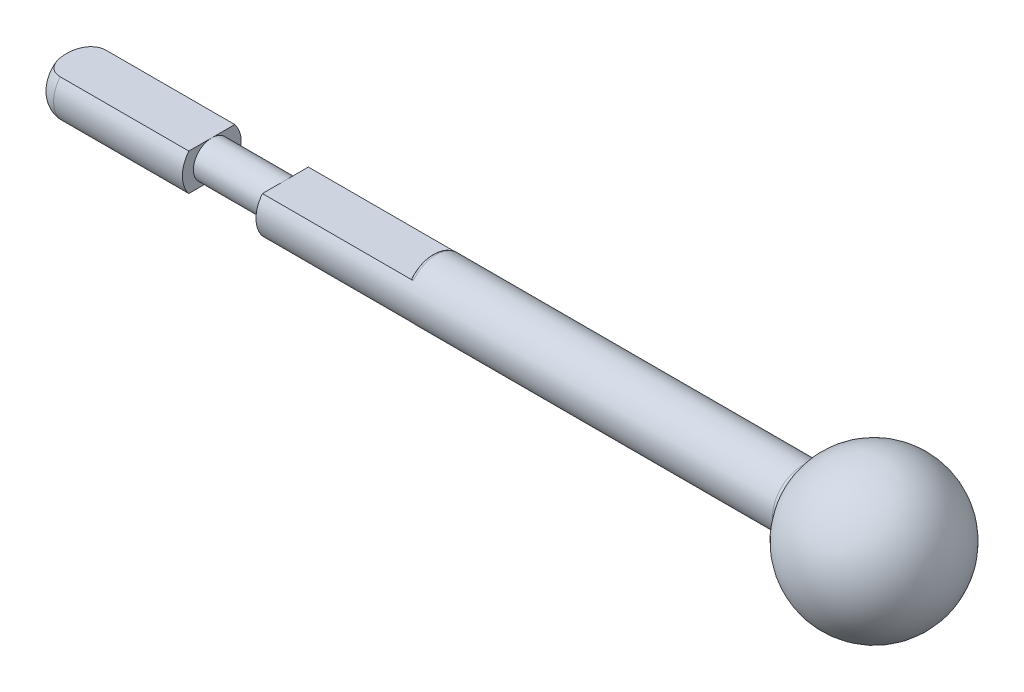
ISO-10303-21;
HEADER;
FILE_DESCRIPTION(('STEP AP214'),'2;1');
FILE_NAME('part.step','',(''),(''),'','','');
FILE_SCHEMA(('AUTOMOTIVE_DESIGN { 1 0 10303 214 1 1 1 1 }'));
ENDSEC;
DATA;
#1=APPLICATION_CONTEXT('core data for automotive mechanical design processes');
#2=APPLICATION_PROTOCOL_DEFINITION('international standard','automotive_design',2000,#1);
#3=PRODUCT_CONTEXT('',#1,'mechanical');
#4=PRODUCT('Part','Part','',(#3));
#5=PRODUCT_RELATED_PRODUCT_CATEGORY('part','',(#4));
#6=PRODUCT_DEFINITION_FORMATION('','',#4);
#7=PRODUCT_DEFINITION_CONTEXT('part definition',#1,'design');
#8=PRODUCT_DEFINITION('design','',#6,#7);
#9=PRODUCT_DEFINITION_SHAPE('','',#8);
#10=(LENGTH_UNIT() NAMED_UNIT(*) SI_UNIT(.MILLI.,.METRE.));
#11=(NAMED_UNIT(*) PLANE_ANGLE_UNIT() SI_UNIT($,.RADIAN.));
#12=(NAMED_UNIT(*) SI_UNIT($,.STERADIAN.) SOLID_ANGLE_UNIT());
#13=UNCERTAINTY_MEASURE_WITH_UNIT(LENGTH_MEASURE(1.E-05),#10,'distance_accuracy_value','');
#14=(GEOMETRIC_REPRESENTATION_CONTEXT(3) GLOBAL_UNCERTAINTY_ASSIGNED_CONTEXT((#13)) GLOBAL_UNIT_ASSIGNED_CONTEXT((#10,
#11,#12)) REPRESENTATION_CONTEXT('',''));
#15=CARTESIAN_POINT('',(0.,0.,0.));
#16=DIRECTION('',(0.,0.,1.));
#17=DIRECTION('',(1.,0.,0.));
#18=AXIS2_PLACEMENT_3D('',#15,#16,#17);
#19=CARTESIAN_POINT('',(4.,0.5,0.));
#20=DIRECTION('',(1.,0.,0.));
#21=DIRECTION('',(0.,0.,-1.));
#22=AXIS2_PLACEMENT_3D('',#19,#20,#21);
#23=PLANE('',#22);
#24=CARTESIAN_POINT('',(4.,0.,0.));
#25=DIRECTION('',(-1.,0.,0.));
#26=DIRECTION('',(0.,0.,1.));
#27=AXIS2_PLACEMENT_3D('',#24,#25,#26);
#28=CIRCLE('',#27,0.8);
#29=CARTESIAN_POINT('',(4.,-0.5,0.62449979983984));
#30=VERTEX_POINT('',#29);
#31=CARTESIAN_POINT('',(4.,0.5,0.62449979983984));
#32=VERTEX_POINT('',#31);
#33=EDGE_CURVE('E146',#30,#32,#28,.T.);
#34=ORIENTED_EDGE('',*,*,#33,.T.);
#35=DIRECTION('',(0.,0.,-1.));
#36=VECTOR('',#35,1.);
#37=CARTESIAN_POINT('',(4.,0.5,0.));
#38=LINE('',#37,#36);
#39=CARTESIAN_POINT('',(4.,0.5,0.));
#40=VERTEX_POINT('',#39);
#41=EDGE_CURVE('E130',#32,#40,#38,.T.);
#42=ORIENTED_EDGE('',*,*,#41,.T.);
#43=CARTESIAN_POINT('',(4.,0.,0.));
#44=DIRECTION('',(-1.,0.,0.));
#45=DIRECTION('',(0.,0.,1.));
#46=AXIS2_PLACEMENT_3D('',#43,#44,#45);
#47=CIRCLE('',#46,0.5);
#48=CARTESIAN_POINT('',(4.,-0.5,0.));
#49=VERTEX_POINT('',#48);
#50=EDGE_CURVE('E161',#49,#40,#47,.T.);
#51=ORIENTED_EDGE('',*,*,#50,.F.);
#52=DIRECTION('',(0.,0.,1.));
#53=VECTOR('',#52,1.);
#54=CARTESIAN_POINT('',(4.,-0.5,0.));
#55=LINE('',#54,#53);
#56=EDGE_CURVE('E155',#49,#30,#55,.T.);
#57=ORIENTED_EDGE('',*,*,#56,.T.);
#58=EDGE_LOOP('',(#34,#42,#51,#57));
#59=FACE_BOUND('',#58,.T.);
#60=ADVANCED_FACE('F35',(#59),#23,.F.);
#61=CARTESIAN_POINT('',(2.,0.8,0.));
#62=DIRECTION('',(-1.,0.,0.));
#63=DIRECTION('',(0.,0.,1.));
#64=AXIS2_PLACEMENT_3D('',#61,#62,#63);
#65=PLANE('',#64);
#66=CARTESIAN_POINT('',(2.,0.,0.));
#67=DIRECTION('',(-1.,0.,0.));
#68=DIRECTION('',(0.,0.,1.));
#69=AXIS2_PLACEMENT_3D('',#66,#67,#68);
#70=CIRCLE('',#69,0.8);
#71=CARTESIAN_POINT('',(2.,0.5,-0.62449979983984));
#72=VERTEX_POINT('',#71);
#73=CARTESIAN_POINT('',(2.,-0.5,-0.62449979983984));
#74=VERTEX_POINT('',#73);
#75=EDGE_CURVE('E304',#72,#74,#70,.T.);
#76=ORIENTED_EDGE('',*,*,#75,.F.);
#77=DIRECTION('',(0.,0.,1.));
#78=VECTOR('',#77,1.);
#79=CARTESIAN_POINT('',(2.,0.5,0.));
#80=LINE('',#79,#78);
#81=CARTESIAN_POINT('',(2.,0.5,0.));
#82=VERTEX_POINT('',#81);
#83=EDGE_CURVE('E317',#72,#82,#80,.T.);
#84=ORIENTED_EDGE('',*,*,#83,.T.);
#85=CARTESIAN_POINT('',(2.,0.,0.));
#86=DIRECTION('',(-1.,0.,0.));
#87=DIRECTION('',(0.,0.,1.));
#88=AXIS2_PLACEMENT_3D('',#85,#86,#87);
#89=CIRCLE('',#88,0.5);
#90=CARTESIAN_POINT('',(2.,-0.5,0.));
#91=VERTEX_POINT('',#90);
#92=EDGE_CURVE('E300',#82,#91,#89,.T.);
#93=ORIENTED_EDGE('',*,*,#92,.T.);
#94=DIRECTION('',(0.,0.,-1.));
#95=VECTOR('',#94,1.);
#96=CARTESIAN_POINT('',(2.,-0.5,0.));
#97=LINE('',#96,#95);
#98=EDGE_CURVE('E307',#91,#74,#97,.T.);
#99=ORIENTED_EDGE('',*,*,#98,.T.);
#100=EDGE_LOOP('',(#76,#84,#93,#99));
#101=FACE_BOUND('',#100,.T.);
#102=ADVANCED_FACE('F274',(#101),#65,.F.);
#103=CARTESIAN_POINT('',(0.,0.,0.));
#104=DIRECTION('',(-1.,0.,0.));
#105=DIRECTION('',(0.,0.,1.));
#106=AXIS2_PLACEMENT_3D('',#103,#104,#105);
#107=CYLINDRICAL_SURFACE('',#106,0.8);
#108=DIRECTION('',(-1.,0.,0.));
#109=VECTOR('',#108,1.);
#110=CARTESIAN_POINT('',(0.,0.5,0.62449979983984));
#111=LINE('',#110,#109);
#112=CARTESIAN_POINT('',(2.,0.5,0.62449979983984));
#113=VERTEX_POINT('',#112);
#114=CARTESIAN_POINT('',(-1.5,0.5,0.62449979983984));
#115=VERTEX_POINT('',#114);
#116=EDGE_CURVE('E168',#113,#115,#111,.T.);
#117=ORIENTED_EDGE('',*,*,#116,.T.);
#118=CARTESIAN_POINT('',(-1.5,0.,0.));
#119=DIRECTION('',(1.,0.,0.));
#120=DIRECTION('',(0.,0.,-1.));
#121=AXIS2_PLACEMENT_3D('',#118,#119,#120);
#122=CIRCLE('',#121,0.8);
#123=CARTESIAN_POINT('',(-1.5,-0.5,0.62449979983984));
#124=VERTEX_POINT('',#123);
#125=EDGE_CURVE('E185',#115,#124,#122,.T.);
#126=ORIENTED_EDGE('',*,*,#125,.T.);
#127=DIRECTION('',(-1.,0.,0.));
#128=VECTOR('',#127,1.);
#129=CARTESIAN_POINT('',(0.,-0.5,0.62449979983984));
#130=LINE('',#129,#128);
#131=CARTESIAN_POINT('',(2.,-0.5,0.62449979983984));
#132=VERTEX_POINT('',#131);
#133=EDGE_CURVE('E156',#124,#132,#130,.F.);
#134=ORIENTED_EDGE('',*,*,#133,.T.);
#135=EDGE_CURVE('E301',#132,#113,#70,.T.);
#136=ORIENTED_EDGE('',*,*,#135,.T.);
#137=EDGE_LOOP('',(#117,#126,#134,#136));
#138=FACE_BOUND('',#137,.T.);
#139=ADVANCED_FACE('F278',(#138),#107,.T.);
#140=CARTESIAN_POINT('',(-2.,0.8,0.));
#141=DIRECTION('',(1.,0.,0.));
#142=DIRECTION('',(0.,0.,-1.));
#143=AXIS2_PLACEMENT_3D('',#140,#141,#142);
#144=PLANE('',#143);
#145=CARTESIAN_POINT('',(-2.,0.,0.));
#146=DIRECTION('',(1.,0.,0.));
#147=DIRECTION('',(0.,0.,-1.));
#148=AXIS2_PLACEMENT_3D('',#145,#146,#147);
#149=CIRCLE('',#148,0.3);
#150=CARTESIAN_POINT('',(-2.,-0.1875,0.23418742493994));
#151=VERTEX_POINT('',#150);
#152=EDGE_CURVE('E53',#151,#151,#149,.F.);
#153=ORIENTED_EDGE('',*,*,#152,.T.);
#154=EDGE_LOOP('',(#153));
#155=FACE_BOUND('',#154,.T.);
#156=ADVANCED_FACE('F230',(#155),#144,.F.);
#157=CARTESIAN_POINT('',(20.,0.,0.));
#158=DIRECTION('',(-1.,0.,0.));
#159=DIRECTION('',(0.,1.,0.));
#160=AXIS2_PLACEMENT_3D('',#157,#158,#159);
#161=SPHERICAL_SURFACE('',#160,2.);
#162=CARTESIAN_POINT('',(18.2185529143395,0.,0.));
#163=DIRECTION('',(0.999999999999999,0.,0.));
#164=DIRECTION('',(0.,0.,-1.));
#165=AXIS2_PLACEMENT_3D('',#162,#163,#164);
#166=CIRCLE('',#165,0.90909090909091);
#167=CARTESIAN_POINT('',(18.2185529143395,0.,-0.90909090909091));
#168=VERTEX_POINT('',#167);
#169=EDGE_CURVE('E219',#168,#168,#166,.T.);
#170=ORIENTED_EDGE('',*,*,#169,.T.);
#171=EDGE_LOOP('',(#170));
#172=FACE_BOUND('',#171,.T.);
#173=ADVANCED_FACE('F256',(#172),#161,.T.);
#174=CARTESIAN_POINT('',(0.,0.,0.));
#175=DIRECTION('',(-1.,0.,0.));
#176=DIRECTION('',(0.,0.,1.));
#177=AXIS2_PLACEMENT_3D('',#174,#175,#176);
#178=CYLINDRICAL_SURFACE('',#177,0.8);
#179=CARTESIAN_POINT('',(18.0404082057735,0.,0.));
#180=DIRECTION('',(0.999999999999999,0.,0.));
#181=DIRECTION('',(0.,0.,-1.));
#182=AXIS2_PLACEMENT_3D('',#179,#180,#181);
#183=CIRCLE('',#182,0.8);
#184=CARTESIAN_POINT('',(18.0404082057735,0.,-0.8));
#185=VERTEX_POINT('',#184);
#186=EDGE_CURVE('E174',#185,#185,#183,.F.);
#187=ORIENTED_EDGE('',*,*,#186,.T.);
#188=EDGE_LOOP('',(#187));
#189=FACE_BOUND('',#188,.T.);
#190=DIRECTION('',(-1.,0.,0.));
#191=VECTOR('',#190,1.);
#192=CARTESIAN_POINT('',(8.,-0.5,0.62449979983984));
#193=LINE('',#192,#191);
#194=CARTESIAN_POINT('',(8.1,-0.5,0.62449979983984));
#195=VERTEX_POINT('',#194);
#196=EDGE_CURVE('E311',#195,#30,#193,.T.);
#197=ORIENTED_EDGE('',*,*,#196,.F.);
#198=CARTESIAN_POINT('',(8.1,0.,0.));
#199=DIRECTION('',(1.,0.,0.));
#200=DIRECTION('',(0.,0.,-1.));
#201=AXIS2_PLACEMENT_3D('',#198,#199,#200);
#202=CIRCLE('',#201,0.8);
#203=CARTESIAN_POINT('',(8.1,-0.5,-0.62449979983984));
#204=VERTEX_POINT('',#203);
#205=EDGE_CURVE('E178',#195,#204,#202,.T.);
#206=ORIENTED_EDGE('',*,*,#205,.T.);
#207=DIRECTION('',(-1.,0.,0.));
#208=VECTOR('',#207,1.);
#209=CARTESIAN_POINT('',(8.,-0.5,-0.62449979983984));
#210=LINE('',#209,#208);
#211=CARTESIAN_POINT('',(4.,-0.5,-0.62449979983984));
#212=VERTEX_POINT('',#211);
#213=EDGE_CURVE('E310',#204,#212,#210,.T.);
#214=ORIENTED_EDGE('',*,*,#213,.T.);
#215=CARTESIAN_POINT('',(4.,0.5,-0.62449979983984));
#216=VERTEX_POINT('',#215);
#217=EDGE_CURVE('E157',#216,#212,#28,.T.);
#218=ORIENTED_EDGE('',*,*,#217,.F.);
#219=DIRECTION('',(-1.,0.,0.));
#220=VECTOR('',#219,1.);
#221=CARTESIAN_POINT('',(8.,0.5,-0.62449979983984));
#222=LINE('',#221,#220);
#223=CARTESIAN_POINT('',(8.1,0.5,-0.62449979983984));
#224=VERTEX_POINT('',#223);
#225=EDGE_CURVE('E151',#224,#216,#222,.T.);
#226=ORIENTED_EDGE('',*,*,#225,.F.);
#227=CARTESIAN_POINT('',(8.1,0.,0.));
#228=DIRECTION('',(-1.,0.,0.));
#229=DIRECTION('',(0.,0.,1.));
#230=AXIS2_PLACEMENT_3D('',#227,#228,#229);
#231=CIRCLE('',#230,0.8);
#232=CARTESIAN_POINT('',(8.1,0.5,0.62449979983984));
#233=VERTEX_POINT('',#232);
#234=EDGE_CURVE('E148',#224,#233,#231,.F.);
#235=ORIENTED_EDGE('',*,*,#234,.T.);
#236=DIRECTION('',(-1.,0.,0.));
#237=VECTOR('',#236,1.);
#238=CARTESIAN_POINT('',(8.,0.5,0.62449979983984));
#239=LINE('',#238,#237);
#240=EDGE_CURVE('E133',#233,#32,#239,.T.);
#241=ORIENTED_EDGE('',*,*,#240,.T.);
#242=ORIENTED_EDGE('',*,*,#33,.F.);
#243=EDGE_LOOP('',(#197,#206,#214,#218,#226,#235,#241,#242));
#244=FACE_BOUND('',#243,.T.);
#245=ADVANCED_FACE('F145',(#189,#244),#178,.T.);
#246=EDGE_CURVE('E299',#40,#49,#47,.T.);
#247=ORIENTED_EDGE('',*,*,#246,.F.);
#248=EDGE_CURVE('E136',#40,#216,#38,.T.);
#249=ORIENTED_EDGE('',*,*,#248,.T.);
#250=ORIENTED_EDGE('',*,*,#217,.T.);
#251=EDGE_CURVE('E306',#212,#49,#55,.T.);
#252=ORIENTED_EDGE('',*,*,#251,.T.);
#253=EDGE_LOOP('',(#247,#249,#250,#252));
#254=FACE_BOUND('',#253,.T.);
#255=ADVANCED_FACE('F263',(#254),#23,.F.);
#256=CARTESIAN_POINT('',(0.,0.,0.));
#257=DIRECTION('',(-1.,0.,0.));
#258=DIRECTION('',(0.,0.,1.));
#259=AXIS2_PLACEMENT_3D('',#256,#257,#258);
#260=CYLINDRICAL_SURFACE('',#259,0.5);
#261=ORIENTED_EDGE('',*,*,#92,.F.);
#262=EDGE_CURVE('E293',#91,#82,#89,.T.);
#263=ORIENTED_EDGE('',*,*,#262,.F.);
#264=EDGE_LOOP('',(#261,#263));
#265=FACE_BOUND('',#264,.T.);
#266=ORIENTED_EDGE('',*,*,#50,.T.);
#267=ORIENTED_EDGE('',*,*,#246,.T.);
#268=EDGE_LOOP('',(#266,#267));
#269=FACE_BOUND('',#268,.T.);
#270=ADVANCED_FACE('F270',(#265,#269),#260,.T.);
#271=ORIENTED_EDGE('',*,*,#262,.T.);
#272=EDGE_CURVE('E150',#82,#113,#80,.T.);
#273=ORIENTED_EDGE('',*,*,#272,.T.);
#274=ORIENTED_EDGE('',*,*,#135,.F.);
#275=EDGE_CURVE('E297',#132,#91,#97,.T.);
#276=ORIENTED_EDGE('',*,*,#275,.T.);
#277=EDGE_LOOP('',(#271,#273,#274,#276));
#278=FACE_BOUND('',#277,.T.);
#279=ADVANCED_FACE('F280',(#278),#65,.F.);
#280=DIRECTION('',(-1.,0.,0.));
#281=VECTOR('',#280,1.);
#282=CARTESIAN_POINT('',(0.,-0.5,-0.62449979983984));
#283=LINE('',#282,#281);
#284=CARTESIAN_POINT('',(-1.5,-0.5,-0.62449979983984));
#285=VERTEX_POINT('',#284);
#286=EDGE_CURVE('E159',#74,#285,#283,.T.);
#287=ORIENTED_EDGE('',*,*,#286,.T.);
#288=CARTESIAN_POINT('',(-1.5,0.,0.));
#289=DIRECTION('',(-1.,0.,0.));
#290=DIRECTION('',(0.,0.,1.));
#291=AXIS2_PLACEMENT_3D('',#288,#289,#290);
#292=CIRCLE('',#291,0.8);
#293=CARTESIAN_POINT('',(-1.5,0.5,-0.62449979983984));
#294=VERTEX_POINT('',#293);
#295=EDGE_CURVE('E60',#285,#294,#292,.F.);
#296=ORIENTED_EDGE('',*,*,#295,.T.);
#297=DIRECTION('',(-1.,0.,0.));
#298=VECTOR('',#297,1.);
#299=CARTESIAN_POINT('',(0.,0.5,-0.62449979983984));
#300=LINE('',#299,#298);
#301=EDGE_CURVE('E166',#294,#72,#300,.F.);
#302=ORIENTED_EDGE('',*,*,#301,.T.);
#303=ORIENTED_EDGE('',*,*,#75,.T.);
#304=EDGE_LOOP('',(#287,#296,#302,#303));
#305=FACE_BOUND('',#304,.T.);
#306=ADVANCED_FACE('F205',(#305),#107,.T.);
#307=CARTESIAN_POINT('',(8.,-0.5,0.62449979983984));
#308=DIRECTION('',(0.,1.,0.));
#309=DIRECTION('',(0.,0.,1.));
#310=AXIS2_PLACEMENT_3D('',#307,#308,#309);
#311=PLANE('',#310);
#312=ORIENTED_EDGE('',*,*,#133,.F.);
#313=CARTESIAN_POINT('',(-1.5,-0.5,0.62449979983984));
#314=CARTESIAN_POINT('',(-1.52276043729101,-0.5,0.624529288127387));
#315=CARTESIAN_POINT('',(-1.54550278307298,-0.5,0.622511211084182));
#316=CARTESIAN_POINT('',(-1.59022763302161,-0.5,0.614611379341471));
#317=CARTESIAN_POINT('',(-1.61221250106136,-0.5,0.608743062737441));
#318=CARTESIAN_POINT('',(-1.65485971533661,-0.5,0.593373508635469));
#319=CARTESIAN_POINT('',(-1.67552243173464,-0.5,0.583873293200589));
#320=CARTESIAN_POINT('',(-1.71502284651683,-0.5,0.561628714439818));
#321=CARTESIAN_POINT('',(-1.73385963898716,-0.5,0.548882752028357));
#322=CARTESIAN_POINT('',(-1.76980434633808,-0.5,0.520230325505329));
#323=CARTESIAN_POINT('',(-1.78685020263957,-0.5,0.50424634761784));
#324=CARTESIAN_POINT('',(-1.81835535800332,-0.5,0.469924743436723));
#325=CARTESIAN_POINT('',(-1.83281425212214,-0.5,0.451586749433488));
#326=CARTESIAN_POINT('',(-1.86419585237101,-0.5,0.40560230481385));
#327=CARTESIAN_POINT('',(-1.87988507843464,-0.5,0.377112030188825));
#328=CARTESIAN_POINT('',(-1.90642060473303,-0.5,0.317962489172058));
#329=CARTESIAN_POINT('',(-1.91725615268056,-0.5,0.287298579774442));
#330=CARTESIAN_POINT('',(-1.93967568812722,-0.5,0.207300879337693));
#331=CARTESIAN_POINT('',(-1.94827170345253,-0.5,0.157140651253213));
#332=CARTESIAN_POINT('',(-1.95563637370002,-0.5,0.0814207562684646));
#333=CARTESIAN_POINT('',(-1.95716658924939,-0.5,0.0560376047841217));
#334=CARTESIAN_POINT('',(-1.95852803277919,-0.5,0.00522518540384254));
#335=CARTESIAN_POINT('',(-1.95835978155452,-0.5,-0.0202040659656362));
#336=CARTESIAN_POINT('',(-1.95555581704147,-0.5,-0.0904686067872057));
#337=CARTESIAN_POINT('',(-1.95112889898375,-0.5,-0.135249471673551));
#338=CARTESIAN_POINT('',(-1.9355387945787,-0.5,-0.223511554487906));
#339=CARTESIAN_POINT('',(-1.92441309253931,-0.5,-0.266998601557493));
#340=CARTESIAN_POINT('',(-1.89890860182985,-0.5,-0.335973185316695));
#341=CARTESIAN_POINT('',(-1.88707148681556,-0.5,-0.362387687405501));
#342=CARTESIAN_POINT('',(-1.85937729368509,-0.5,-0.413077119769243));
#343=CARTESIAN_POINT('',(-1.84351853365692,-0.5,-0.437351149128071));
#344=CARTESIAN_POINT('',(-1.80755210283899,-0.5,-0.482935602595258));
#345=CARTESIAN_POINT('',(-1.78740576194993,-0.5,-0.504215909984359));
#346=CARTESIAN_POINT('',(-1.74331310385043,-0.5,-0.542395290677107));
#347=CARTESIAN_POINT('',(-1.71937113390608,-0.5,-0.559299318663964));
#348=CARTESIAN_POINT('',(-1.67198192281616,-0.5,-0.585758069912925));
#349=CARTESIAN_POINT('',(-1.64891961607623,-0.5,-0.596003866772059));
#350=CARTESIAN_POINT('',(-1.60127675842844,-0.5,-0.611984506164992));
#351=CARTESIAN_POINT('',(-1.57669692348271,-0.5,-0.617721458670727));
#352=CARTESIAN_POINT('',(-1.52945543298617,-0.5,-0.624036347383801));
#353=CARTESIAN_POINT('',(-1.50685520917805,-0.5,-0.625082557631181));
#354=CARTESIAN_POINT('',(-1.46177127977745,-0.5,-0.623286383642972));
#355=CARTESIAN_POINT('',(-1.43928784525097,-0.5,-0.620437232082785));
#356=CARTESIAN_POINT('',(-1.417216722146,-0.5,-0.615635049793097));
#357=B_SPLINE_CURVE_WITH_KNOTS('',3,(#313,#314,#315,#316,#317,#318,#319,#320,#321,#322,#323,
#324,#325,#326,#327,#328,#329,#330,#331,#332,#333,#334,#335,#336,#337,#338,#339,#340,#341,#342,
#343,#344,#345,#346,#347,#348,#349,#350,#351,#352,#353,#354,#355,#356),.UNSPECIFIED.,.F.,.F.,(4,
2,2,2,2,2,2,2,2,2,2,2,2,2,2,2,2,2,2,2,2,4),(0.,0.0681638720458232,0.136091095314724,
0.203999217043488,0.271940860085591,0.341757507017768,0.411585072975628,0.508607082515775,
0.605842973331477,0.75760835655731,0.833868514887773,0.910105290544264,1.04473430416121,
1.17861688748174,1.26515494459559,1.35172925307535,1.43912024462862,1.52641185788918,
1.6016964779239,1.67694584653657,1.74448690172001,1.81214544368064),.UNSPECIFIED.);
#358=EDGE_CURVE('E188',#124,#285,#357,.T.);
#359=ORIENTED_EDGE('',*,*,#358,.T.);
#360=ORIENTED_EDGE('',*,*,#286,.F.);
#361=ORIENTED_EDGE('',*,*,#98,.F.);
#362=ORIENTED_EDGE('',*,*,#275,.F.);
#363=EDGE_LOOP('',(#312,#359,#360,#361,#362));
#364=FACE_BOUND('',#363,.T.);
#365=ADVANCED_FACE('F203',(#364),#311,.F.);
#366=ORIENTED_EDGE('',*,*,#213,.F.);
#367=CARTESIAN_POINT('',(8.1,-0.5,-0.62449979983984));
#368=CARTESIAN_POINT('',(8.09527641811231,-0.5,-0.624508481156636));
#369=CARTESIAN_POINT('',(8.09056038978629,-0.5,-0.624071717682294));
#370=CARTESIAN_POINT('',(8.08130560718794,-0.5,-0.622379317842864));
#371=CARTESIAN_POINT('',(8.07676596064543,-0.5,-0.621128599537834));
#372=CARTESIAN_POINT('',(8.06797299413522,-0.5,-0.617881238344103));
#373=CARTESIAN_POINT('',(8.06371925227958,-0.5,-0.615885724338854));
#374=CARTESIAN_POINT('',(8.05557424762504,-0.5,-0.611252016923387));
#375=CARTESIAN_POINT('',(8.05168346689909,-0.5,-0.608612985154689));
#376=CARTESIAN_POINT('',(8.04407876474949,-0.5,-0.602610547481808));
#377=CARTESIAN_POINT('',(8.04039385196502,-0.5,-0.599210618860901));
#378=CARTESIAN_POINT('',(8.03353304079424,-0.5,-0.591937023664157));
#379=CARTESIAN_POINT('',(8.03035715492877,-0.5,-0.58806334543937));
#380=CARTESIAN_POINT('',(8.02301445827571,-0.5,-0.577868767501059));
#381=CARTESIAN_POINT('',(8.01917449925401,-0.5,-0.571311472252193));
#382=CARTESIAN_POINT('',(8.01259453522497,-0.5,-0.557645219334605));
#383=CARTESIAN_POINT('',(8.00985957437062,-0.5,-0.550533904763336));
#384=CARTESIAN_POINT('',(8.00499157761407,-0.5,-0.534597374416087));
#385=CARTESIAN_POINT('',(8.00307708917064,-0.5,-0.525706577428801));
#386=CARTESIAN_POINT('',(8.00059019720603,-0.5,-0.507832022886103));
#387=CARTESIAN_POINT('',(8.00000368884655,-0.5,-0.498850270025879));
#388=CARTESIAN_POINT('',(8.,-0.5,-0.489897948556636));
#389=B_SPLINE_CURVE_WITH_KNOTS('',3,(#367,#368,#369,#370,#371,#372,#373,#374,#375,#376,#377,
#378,#379,#380,#381,#382,#383,#384,#385,#386,#387,#388),.UNSPECIFIED.,.F.,.F.,(4,2,2,2,2,2,2,2,
2,2,4),(0.,0.0141386658099852,0.0281926866422534,0.0422254917974627,0.0562766771307825,
0.0712631056491182,0.0862499027403644,0.108920969902322,0.131694388584221,0.158869961994206,
0.185755514507732),.UNSPECIFIED.);
#390=CARTESIAN_POINT('',(8.,-0.5,-0.489897948556635));
#391=VERTEX_POINT('',#390);
#392=EDGE_CURVE('E218',#204,#391,#389,.T.);
#393=ORIENTED_EDGE('',*,*,#392,.T.);
#394=DIRECTION('',(0.,0.,-1.));
#395=VECTOR('',#394,1.);
#396=CARTESIAN_POINT('',(8.,-0.5,0.62449979983984));
#397=LINE('',#396,#395);
#398=CARTESIAN_POINT('',(8.,-0.5,0.489897948556635));
#399=VERTEX_POINT('',#398);
#400=EDGE_CURVE('E141',#399,#391,#397,.T.);
#401=ORIENTED_EDGE('',*,*,#400,.F.);
#402=CARTESIAN_POINT('',(8.,-0.5,0.489897948556635));
#403=CARTESIAN_POINT('',(8.00000435993998,-0.5,0.500168864760184));
#404=CARTESIAN_POINT('',(8.00077783115019,-0.5,0.510498834072826));
#405=CARTESIAN_POINT('',(8.00408579791667,-0.5,0.530975852404236));
#406=CARTESIAN_POINT('',(8.00663856802057,-0.5,0.541119871827363));
#407=CARTESIAN_POINT('',(8.01257500341533,-0.5,0.557489397461155));
#408=CARTESIAN_POINT('',(8.01541320321281,-0.5,0.563910700607749));
#409=CARTESIAN_POINT('',(8.02204946499181,-0.5,0.576218307900041));
#410=CARTESIAN_POINT('',(8.02584390932224,-0.5,0.582106517199205));
#411=CARTESIAN_POINT('',(8.03359876647645,-0.5,0.592049756376144));
#412=CARTESIAN_POINT('',(8.0373860479648,-0.5,0.596239324537594));
#413=CARTESIAN_POINT('',(8.04559694028515,-0.5,0.603948702971858));
#414=CARTESIAN_POINT('',(8.05002024793697,-0.5,0.607468830506428));
#415=CARTESIAN_POINT('',(8.05870707361459,-0.5,0.613170164623718));
#416=CARTESIAN_POINT('',(8.06288986221698,-0.5,0.615474173006505));
#417=CARTESIAN_POINT('',(8.07157919107877,-0.5,0.619350638603707));
#418=CARTESIAN_POINT('',(8.07608518020963,-0.5,0.620924308506272));
#419=CARTESIAN_POINT('',(8.08384339848445,-0.5,0.622883161095602));
#420=CARTESIAN_POINT('',(8.08704174221272,-0.5,0.623486780375488));
#421=CARTESIAN_POINT('',(8.093492537078,-0.5,0.624296204168552));
#422=CARTESIAN_POINT('',(8.09674505471788,-0.5,0.624501476789303));
#423=CARTESIAN_POINT('',(8.09999999999742,-0.5,0.624499799850064));
#424=B_SPLINE_CURVE_WITH_KNOTS('',3,(#402,#403,#404,#405,#406,#407,#408,#409,#410,#411,#412,
#413,#414,#415,#416,#417,#418,#419,#420,#421,#422,#423),.UNSPECIFIED.,.F.,.F.,(4,2,2,2,2,2,2,2,
2,2,4),(0.,0.0308815245506793,0.0620849877586061,0.08307496804419,0.103986701114994,
0.120865546562963,0.137736372733217,0.152003013191942,0.166245879144389,0.175986896018828,
0.185740910661916),.UNSPECIFIED.);
#425=EDGE_CURVE('E211',#399,#195,#424,.T.);
#426=ORIENTED_EDGE('',*,*,#425,.T.);
#427=ORIENTED_EDGE('',*,*,#196,.T.);
#428=ORIENTED_EDGE('',*,*,#56,.F.);
#429=ORIENTED_EDGE('',*,*,#251,.F.);
#430=EDGE_LOOP('',(#366,#393,#401,#426,#427,#428,#429));
#431=FACE_BOUND('',#430,.T.);
#432=ADVANCED_FACE('F197',(#431),#311,.F.);
#433=CARTESIAN_POINT('',(8.,0.,0.));
#434=DIRECTION('',(1.,0.,0.));
#435=DIRECTION('',(0.,0.,-1.));
#436=AXIS2_PLACEMENT_3D('',#433,#434,#435);
#437=PLANE('',#436);
#438=ORIENTED_EDGE('',*,*,#400,.T.);
#439=CARTESIAN_POINT('',(8.,0.,0.));
#440=DIRECTION('',(1.,0.,0.));
#441=DIRECTION('',(0.,0.,-1.));
#442=AXIS2_PLACEMENT_3D('',#439,#440,#441);
#443=CIRCLE('',#442,0.7);
#444=EDGE_CURVE('E171',#391,#399,#443,.F.);
#445=ORIENTED_EDGE('',*,*,#444,.T.);
#446=EDGE_LOOP('',(#438,#445));
#447=FACE_BOUND('',#446,.T.);
#448=ADVANCED_FACE('F202',(#447),#437,.F.);
#449=CARTESIAN_POINT('',(8.,0.5,0.62449979983984));
#450=DIRECTION('',(0.,-1.,0.));
#451=DIRECTION('',(0.,0.,-1.));
#452=AXIS2_PLACEMENT_3D('',#449,#450,#451);
#453=PLANE('',#452);
#454=ORIENTED_EDGE('',*,*,#301,.F.);
#455=CARTESIAN_POINT('',(-1.5,0.5,-0.62449979983984));
#456=CARTESIAN_POINT('',(-1.52276043729101,0.5,-0.624529288127387));
#457=CARTESIAN_POINT('',(-1.54550278307298,0.5,-0.622511211084182));
#458=CARTESIAN_POINT('',(-1.59022763302161,0.5,-0.614611379341471));
#459=CARTESIAN_POINT('',(-1.61221250106136,0.5,-0.608743062737441));
#460=CARTESIAN_POINT('',(-1.65485971533661,0.5,-0.593373508635469));
#461=CARTESIAN_POINT('',(-1.67552243173464,0.5,-0.583873293200589));
#462=CARTESIAN_POINT('',(-1.71502284651683,0.5,-0.561628714439818));
#463=CARTESIAN_POINT('',(-1.73385963898716,0.5,-0.548882752028357));
#464=CARTESIAN_POINT('',(-1.76980434633808,0.5,-0.520230325505329));
#465=CARTESIAN_POINT('',(-1.78685020263957,0.5,-0.50424634761784));
#466=CARTESIAN_POINT('',(-1.81835535800332,0.5,-0.469924743436723));
#467=CARTESIAN_POINT('',(-1.83281425212214,0.5,-0.451586749433488));
#468=CARTESIAN_POINT('',(-1.86419585237101,0.5,-0.40560230481385));
#469=CARTESIAN_POINT('',(-1.87988507843464,0.5,-0.377112030188825));
#470=CARTESIAN_POINT('',(-1.90642060473303,0.5,-0.317962489172058));
#471=CARTESIAN_POINT('',(-1.91725615268056,0.5,-0.287298579774442));
#472=CARTESIAN_POINT('',(-1.93967568812722,0.5,-0.207300879337693));
#473=CARTESIAN_POINT('',(-1.94827170345253,0.5,-0.157140651253213));
#474=CARTESIAN_POINT('',(-1.95563637370002,0.5,-0.0814207562684646));
#475=CARTESIAN_POINT('',(-1.95716658924939,0.5,-0.0560376047841217));
#476=CARTESIAN_POINT('',(-1.95852803277919,0.5,-0.00522518540384254));
#477=CARTESIAN_POINT('',(-1.95835978155452,0.5,0.0202040659656362));
#478=CARTESIAN_POINT('',(-1.95555581704147,0.5,0.0904686067872057));
#479=CARTESIAN_POINT('',(-1.95112889898375,0.5,0.135249471673551));
#480=CARTESIAN_POINT('',(-1.9355387945787,0.5,0.223511554487906));
#481=CARTESIAN_POINT('',(-1.92441309253931,0.5,0.266998601557493));
#482=CARTESIAN_POINT('',(-1.89890860182985,0.5,0.335973185316695));
#483=CARTESIAN_POINT('',(-1.88707148681556,0.5,0.362387687405501));
#484=CARTESIAN_POINT('',(-1.85937729368509,0.5,0.413077119769243));
#485=CARTESIAN_POINT('',(-1.84351853365692,0.5,0.437351149128071));
#486=CARTESIAN_POINT('',(-1.80755210283899,0.5,0.482935602595258));
#487=CARTESIAN_POINT('',(-1.78740576194993,0.5,0.504215909984359));
#488=CARTESIAN_POINT('',(-1.74331310385043,0.5,0.542395290677107));
#489=CARTESIAN_POINT('',(-1.71937113390608,0.5,0.559299318663964));
#490=CARTESIAN_POINT('',(-1.67198192281616,0.5,0.585758069912925));
#491=CARTESIAN_POINT('',(-1.64891961607623,0.5,0.596003866772059));
#492=CARTESIAN_POINT('',(-1.60127675842844,0.5,0.611984506164992));
#493=CARTESIAN_POINT('',(-1.57669692348271,0.5,0.617721458670727));
#494=CARTESIAN_POINT('',(-1.52945543298617,0.5,0.624036347383801));
#495=CARTESIAN_POINT('',(-1.50685520917805,0.5,0.625082557631181));
#496=CARTESIAN_POINT('',(-1.46177127977745,0.5,0.623286383642972));
#497=CARTESIAN_POINT('',(-1.43928784525097,0.5,0.620437232082785));
#498=CARTESIAN_POINT('',(-1.417216722146,0.5,0.615635049793097));
#499=B_SPLINE_CURVE_WITH_KNOTS('',3,(#455,#456,#457,#458,#459,#460,#461,#462,#463,#464,#465,
#466,#467,#468,#469,#470,#471,#472,#473,#474,#475,#476,#477,#478,#479,#480,#481,#482,#483,#484,
#485,#486,#487,#488,#489,#490,#491,#492,#493,#494,#495,#496,#497,#498),.UNSPECIFIED.,.F.,.F.,(4,
2,2,2,2,2,2,2,2,2,2,2,2,2,2,2,2,2,2,2,2,4),(0.,0.0681638720458232,0.136091095314724,
0.203999217043488,0.271940860085591,0.341757507017768,0.411585072975628,0.508607082515775,
0.605842973331477,0.75760835655731,0.833868514887773,0.910105290544264,1.04473430416121,
1.17861688748174,1.26515494459559,1.35172925307535,1.43912024462862,1.52641185788918,
1.6016964779239,1.67694584653657,1.74448690172001,1.81214544368064),.UNSPECIFIED.);
#500=EDGE_CURVE('E247',#294,#115,#499,.T.);
#501=ORIENTED_EDGE('',*,*,#500,.T.);
#502=ORIENTED_EDGE('',*,*,#116,.F.);
#503=ORIENTED_EDGE('',*,*,#272,.F.);
#504=ORIENTED_EDGE('',*,*,#83,.F.);
#505=EDGE_LOOP('',(#454,#501,#502,#503,#504));
#506=FACE_BOUND('',#505,.T.);
#507=ADVANCED_FACE('F244',(#506),#453,.F.);
#508=ORIENTED_EDGE('',*,*,#240,.F.);
#509=CARTESIAN_POINT('',(8.1,0.5,0.62449979983984));
#510=CARTESIAN_POINT('',(8.09527641811231,0.5,0.624508481156637));
#511=CARTESIAN_POINT('',(8.09056038978629,0.5,0.624071717682294));
#512=CARTESIAN_POINT('',(8.08130560718794,0.5,0.622379317842864));
#513=CARTESIAN_POINT('',(8.07676596064543,0.5,0.621128599537834));
#514=CARTESIAN_POINT('',(8.06797299413522,0.5,0.617881238344103));
#515=CARTESIAN_POINT('',(8.06371925227958,0.5,0.615885724338854));
#516=CARTESIAN_POINT('',(8.05557424762504,0.5,0.611252016923387));
#517=CARTESIAN_POINT('',(8.05168346689909,0.5,0.60861298515469));
#518=CARTESIAN_POINT('',(8.04407876474949,0.5,0.602610547481808));
#519=CARTESIAN_POINT('',(8.04039385196502,0.5,0.599210618860901));
#520=CARTESIAN_POINT('',(8.03353304079424,0.5,0.591937023664157));
#521=CARTESIAN_POINT('',(8.03035715492877,0.5,0.58806334543937));
#522=CARTESIAN_POINT('',(8.02301445827571,0.5,0.577868767501059));
#523=CARTESIAN_POINT('',(8.01917449925401,0.5,0.571311472252193));
#524=CARTESIAN_POINT('',(8.01259453522497,0.5,0.557645219334605));
#525=CARTESIAN_POINT('',(8.00985957437062,0.5,0.550533904763336));
#526=CARTESIAN_POINT('',(8.00499157761407,0.5,0.534597374416087));
#527=CARTESIAN_POINT('',(8.00307708917064,0.5,0.525706577428801));
#528=CARTESIAN_POINT('',(8.00059019720603,0.5,0.507832022886103));
#529=CARTESIAN_POINT('',(8.00000368884655,0.5,0.498850270025879));
#530=CARTESIAN_POINT('',(8.,0.5,0.489897948556636));
#531=B_SPLINE_CURVE_WITH_KNOTS('',3,(#509,#510,#511,#512,#513,#514,#515,#516,#517,#518,#519,
#520,#521,#522,#523,#524,#525,#526,#527,#528,#529,#530),.UNSPECIFIED.,.F.,.F.,(4,2,2,2,2,2,2,2,
2,2,4),(0.,0.0141386658099852,0.0281926866422534,0.0422254917974608,0.0562766771307825,
0.0712631056491181,0.0862499027403643,0.108920969902322,0.131694388584221,0.158869961994206,
0.185755514507732),.UNSPECIFIED.);
#532=CARTESIAN_POINT('',(8.,0.5,0.489897948556635));
#533=VERTEX_POINT('',#532);
#534=EDGE_CURVE('E12',#233,#533,#531,.T.);
#535=ORIENTED_EDGE('',*,*,#534,.T.);
#536=DIRECTION('',(0.,0.,1.));
#537=VECTOR('',#536,1.);
#538=CARTESIAN_POINT('',(8.,0.5,0.62449979983984));
#539=LINE('',#538,#537);
#540=CARTESIAN_POINT('',(8.,0.5,-0.489897948556635));
#541=VERTEX_POINT('',#540);
#542=EDGE_CURVE('E319',#541,#533,#539,.T.);
#543=ORIENTED_EDGE('',*,*,#542,.F.);
#544=CARTESIAN_POINT('',(8.,0.5,-0.489897948556635));
#545=CARTESIAN_POINT('',(8.00000435993998,0.5,-0.500168864760184));
#546=CARTESIAN_POINT('',(8.00077783115019,0.5,-0.510498834072826));
#547=CARTESIAN_POINT('',(8.00408579791667,0.5,-0.530975852404236));
#548=CARTESIAN_POINT('',(8.00663856802057,0.5,-0.541119871827363));
#549=CARTESIAN_POINT('',(8.01257500341533,0.5,-0.557489397461155));
#550=CARTESIAN_POINT('',(8.01541320321281,0.5,-0.563910700607749));
#551=CARTESIAN_POINT('',(8.02204946499181,0.5,-0.576218307900041));
#552=CARTESIAN_POINT('',(8.02584390932224,0.5,-0.582106517199205));
#553=CARTESIAN_POINT('',(8.03359876647645,0.5,-0.592049756376144));
#554=CARTESIAN_POINT('',(8.0373860479648,0.5,-0.596239324537594));
#555=CARTESIAN_POINT('',(8.04559694028515,0.5,-0.603948702971858));
#556=CARTESIAN_POINT('',(8.05002024793697,0.5,-0.607468830506428));
#557=CARTESIAN_POINT('',(8.05870707361459,0.5,-0.613170164623718));
#558=CARTESIAN_POINT('',(8.06288986221698,0.5,-0.615474173006505));
#559=CARTESIAN_POINT('',(8.07157919107877,0.5,-0.619350638603707));
#560=CARTESIAN_POINT('',(8.07608518020963,0.5,-0.620924308506272));
#561=CARTESIAN_POINT('',(8.08384339848445,0.5,-0.622883161095602));
#562=CARTESIAN_POINT('',(8.08704174221272,0.5,-0.623486780375488));
#563=CARTESIAN_POINT('',(8.093492537078,0.5,-0.624296204168552));
#564=CARTESIAN_POINT('',(8.09674505471788,0.5,-0.624501476789303));
#565=CARTESIAN_POINT('',(8.09999999999742,0.5,-0.624499799850064));
#566=B_SPLINE_CURVE_WITH_KNOTS('',3,(#544,#545,#546,#547,#548,#549,#550,#551,#552,#553,#554,
#555,#556,#557,#558,#559,#560,#561,#562,#563,#564,#565),.UNSPECIFIED.,.F.,.F.,(4,2,2,2,2,2,2,2,
2,2,4),(0.,0.0308815245506793,0.0620849877586061,0.08307496804419,0.103986701114994,
0.120865546562963,0.137736372733217,0.152003013191942,0.166245879144389,0.175986896018828,
0.185740910661916),.UNSPECIFIED.);
#567=EDGE_CURVE('E48',#541,#224,#566,.T.);
#568=ORIENTED_EDGE('',*,*,#567,.T.);
#569=ORIENTED_EDGE('',*,*,#225,.T.);
#570=ORIENTED_EDGE('',*,*,#248,.F.);
#571=ORIENTED_EDGE('',*,*,#41,.F.);
#572=EDGE_LOOP('',(#508,#535,#543,#568,#569,#570,#571));
#573=FACE_BOUND('',#572,.T.);
#574=ADVANCED_FACE('F132',(#573),#453,.F.);
#575=CARTESIAN_POINT('',(8.,0.,0.));
#576=DIRECTION('',(-1.,0.,0.));
#577=DIRECTION('',(0.,0.,1.));
#578=AXIS2_PLACEMENT_3D('',#575,#576,#577);
#579=PLANE('',#578);
#580=ORIENTED_EDGE('',*,*,#542,.T.);
#581=CARTESIAN_POINT('',(8.,0.,0.));
#582=DIRECTION('',(-1.,0.,0.));
#583=DIRECTION('',(0.,0.,1.));
#584=AXIS2_PLACEMENT_3D('',#581,#582,#583);
#585=CIRCLE('',#584,0.7);
#586=EDGE_CURVE('E181',#533,#541,#585,.T.);
#587=ORIENTED_EDGE('',*,*,#586,.T.);
#588=EDGE_LOOP('',(#580,#587));
#589=FACE_BOUND('',#588,.T.);
#590=ADVANCED_FACE('F228',(#589),#579,.T.);
#591=CARTESIAN_POINT('',(8.1,0.,0.));
#592=DIRECTION('',(1.,0.,0.));
#593=DIRECTION('',(0.,0.,-1.));
#594=AXIS2_PLACEMENT_3D('',#591,#592,#593);
#595=TOROIDAL_SURFACE('',#594,0.7,0.1);
#596=ORIENTED_EDGE('',*,*,#392,.F.);
#597=ORIENTED_EDGE('',*,*,#205,.F.);
#598=ORIENTED_EDGE('',*,*,#425,.F.);
#599=ORIENTED_EDGE('',*,*,#444,.F.);
#600=EDGE_LOOP('',(#596,#597,#598,#599));
#601=FACE_BOUND('',#600,.T.);
#602=ADVANCED_FACE('F223',(#601),#595,.T.);
#603=CARTESIAN_POINT('',(8.1,0.,0.));
#604=DIRECTION('',(-1.,0.,0.));
#605=DIRECTION('',(0.,0.,1.));
#606=AXIS2_PLACEMENT_3D('',#603,#604,#605);
#607=TOROIDAL_SURFACE('',#606,0.7,0.1);
#608=ORIENTED_EDGE('',*,*,#534,.F.);
#609=ORIENTED_EDGE('',*,*,#234,.F.);
#610=ORIENTED_EDGE('',*,*,#567,.F.);
#611=ORIENTED_EDGE('',*,*,#586,.F.);
#612=EDGE_LOOP('',(#608,#609,#610,#611));
#613=FACE_BOUND('',#612,.T.);
#614=ADVANCED_FACE('F227',(#613),#607,.T.);
#615=CARTESIAN_POINT('',(-1.5,0.,0.));
#616=DIRECTION('',(1.,0.,0.));
#617=DIRECTION('',(0.,0.,-1.));
#618=AXIS2_PLACEMENT_3D('',#615,#616,#617);
#619=DEGENERATE_TOROIDAL_SURFACE('',#618,0.3,0.5,.T.);
#620=ORIENTED_EDGE('',*,*,#358,.F.);
#621=ORIENTED_EDGE('',*,*,#125,.F.);
#622=ORIENTED_EDGE('',*,*,#500,.F.);
#623=ORIENTED_EDGE('',*,*,#295,.F.);
#624=EDGE_LOOP('',(#620,#621,#622,#623));
#625=FACE_BOUND('',#624,.T.);
#626=ORIENTED_EDGE('',*,*,#152,.F.);
#627=EDGE_LOOP('',(#626));
#628=FACE_BOUND('',#627,.T.);
#629=ADVANCED_FACE('F195',(#625,#628),#619,.T.);
#630=CARTESIAN_POINT('',(18.0404082057735,0.,0.));
#631=DIRECTION('',(0.999999999999999,0.,0.));
#632=DIRECTION('',(0.,0.,-1.));
#633=AXIS2_PLACEMENT_3D('',#630,#631,#632);
#634=TOROIDAL_SURFACE('',#633,1.,0.2);
#635=ORIENTED_EDGE('',*,*,#169,.F.);
#636=EDGE_LOOP('',(#635));
#637=FACE_BOUND('',#636,.T.);
#638=ORIENTED_EDGE('',*,*,#186,.F.);
#639=EDGE_LOOP('',(#638));
#640=FACE_BOUND('',#639,.T.);
#641=ADVANCED_FACE('F37',(#637,#640),#634,.F.);
#642=CLOSED_SHELL('',(#60,#102,#139,#156,#173,#245,#255,#270,#279,#306,#365,#432,#448,#507,#574,
#590,#602,#614,#629,#641));
#643=MANIFOLD_SOLID_BREP('B2',#642);
#644=ADVANCED_BREP_SHAPE_REPRESENTATION('',(#18,#643),#14);
#645=SHAPE_DEFINITION_REPRESENTATION(#9,#644);
ENDSEC;
END-ISO-10303-21;
